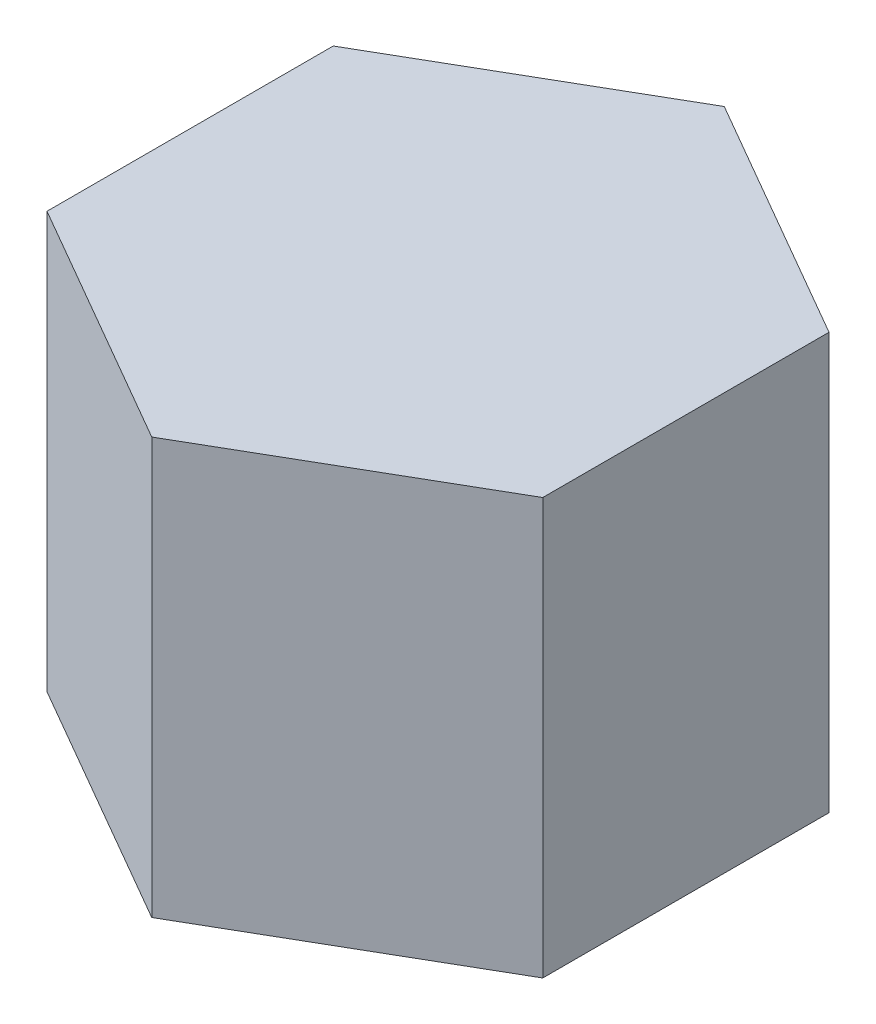
ISO-10303-21;
HEADER;
FILE_DESCRIPTION(('STEP AP214'),'2;1');
FILE_NAME('part.step','',(''),(''),'','','');
FILE_SCHEMA(('AUTOMOTIVE_DESIGN { 1 0 10303 214 1 1 1 1 }'));
ENDSEC;
DATA;
#1=APPLICATION_CONTEXT('core data for automotive mechanical design processes');
#2=APPLICATION_PROTOCOL_DEFINITION('international standard','automotive_design',2000,#1);
#3=PRODUCT_CONTEXT('',#1,'mechanical');
#4=PRODUCT('Part','Part','',(#3));
#5=PRODUCT_RELATED_PRODUCT_CATEGORY('part','',(#4));
#6=PRODUCT_DEFINITION_FORMATION('','',#4);
#7=PRODUCT_DEFINITION_CONTEXT('part definition',#1,'design');
#8=PRODUCT_DEFINITION('design','',#6,#7);
#9=PRODUCT_DEFINITION_SHAPE('','',#8);
#10=(LENGTH_UNIT() NAMED_UNIT(*) SI_UNIT(.MILLI.,.METRE.));
#11=(NAMED_UNIT(*) PLANE_ANGLE_UNIT() SI_UNIT($,.RADIAN.));
#12=(NAMED_UNIT(*) SI_UNIT($,.STERADIAN.) SOLID_ANGLE_UNIT());
#13=UNCERTAINTY_MEASURE_WITH_UNIT(LENGTH_MEASURE(1.E-05),#10,'distance_accuracy_value','');
#14=(GEOMETRIC_REPRESENTATION_CONTEXT(3) GLOBAL_UNCERTAINTY_ASSIGNED_CONTEXT((#13)) GLOBAL_UNIT_ASSIGNED_CONTEXT((#10,
#11,#12)) REPRESENTATION_CONTEXT('',''));
#15=CARTESIAN_POINT('',(0.,0.,0.));
#16=DIRECTION('',(0.,0.,1.));
#17=DIRECTION('',(1.,0.,0.));
#18=AXIS2_PLACEMENT_3D('',#15,#16,#17);
#19=CARTESIAN_POINT('',(207.839551417382,-147.556598747966,292.547996624279));
#20=DIRECTION('',(-0.500000000000028,0.,-0.866025403784422));
#21=DIRECTION('',(-0.866025403784423,0.,0.500000000000028));
#22=AXIS2_PLACEMENT_3D('',#19,#20,#21);
#23=PLANE('',#22);
#24=CARTESIAN_POINT('',(208.142660308706,-147.047793579175,292.372996624279));
#25=DIRECTION('',(-0.866025403784422,0.,0.500000000000028));
#26=VECTOR('',#25,1.);
#27=LINE('',#24,#26);
#28=CARTESIAN_POINT('',(208.142660308706,-147.047793579175,292.372996624279));
#29=VERTEX_POINT('',#28);
#30=CARTESIAN_POINT('',(207.839551417382,-147.047793579175,292.547996624279));
#31=VERTEX_POINT('',#30);
#32=EDGE_CURVE('E170',#29,#31,#27,.T.);
#33=ORIENTED_EDGE('',*,*,#32,.T.);
#34=CARTESIAN_POINT('',(207.839551417382,-147.556598747966,292.547996624279));
#35=DIRECTION('',(0.,1.,0.));
#36=VECTOR('',#35,1.);
#37=LINE('',#34,#36);
#38=CARTESIAN_POINT('',(207.839551417382,-147.556598747966,292.547996624279));
#39=VERTEX_POINT('',#38);
#40=EDGE_CURVE('E35',#39,#31,#37,.T.);
#41=ORIENTED_EDGE('',*,*,#40,.F.);
#42=CARTESIAN_POINT('',(208.142660308706,-147.556598747966,292.372996624279));
#43=DIRECTION('',(-0.866025403784422,0.,0.500000000000028));
#44=VECTOR('',#43,1.);
#45=LINE('',#42,#44);
#46=CARTESIAN_POINT('',(208.142660308706,-147.556598747966,292.372996624279));
#47=VERTEX_POINT('',#46);
#48=EDGE_CURVE('E159',#47,#39,#45,.T.);
#49=ORIENTED_EDGE('',*,*,#48,.F.);
#50=CARTESIAN_POINT('',(208.142660308706,-147.556598747966,292.372996624279));
#51=DIRECTION('',(0.,1.,0.));
#52=VECTOR('',#51,1.);
#53=LINE('',#50,#52);
#54=EDGE_CURVE('E10',#47,#29,#53,.T.);
#55=ORIENTED_EDGE('',*,*,#54,.T.);
#56=EDGE_LOOP('',(#33,#41,#49,#55));
#57=FACE_BOUND('',#56,.T.);
#58=ADVANCED_FACE('F16',(#57),#23,.F.);
#59=CARTESIAN_POINT('',(208.142660308706,-147.556598747966,291.594471220494));
#60=DIRECTION('',(-1.,0.,0.));
#61=DIRECTION('',(0.,-1.,0.));
#62=AXIS2_PLACEMENT_3D('',#59,#60,#61);
#63=PLANE('',#62);
#64=CARTESIAN_POINT('',(208.142660308706,-147.047793579175,292.022996624279));
#65=DIRECTION('',(0.,0.,1.));
#66=VECTOR('',#65,1.);
#67=LINE('',#64,#66);
#68=CARTESIAN_POINT('',(208.142660308706,-147.047793579175,292.022996624279));
#69=VERTEX_POINT('',#68);
#70=EDGE_CURVE('E167',#69,#29,#67,.T.);
#71=ORIENTED_EDGE('',*,*,#70,.T.);
#72=ORIENTED_EDGE('',*,*,#54,.F.);
#73=CARTESIAN_POINT('',(208.142660308706,-147.556598747966,292.022996624279));
#74=DIRECTION('',(0.,0.,1.));
#75=VECTOR('',#74,1.);
#76=LINE('',#73,#75);
#77=CARTESIAN_POINT('',(208.142660308706,-147.556598747966,292.022996624279));
#78=VERTEX_POINT('',#77);
#79=EDGE_CURVE('E156',#78,#47,#76,.T.);
#80=ORIENTED_EDGE('',*,*,#79,.F.);
#81=CARTESIAN_POINT('',(208.142660308706,-147.556598747966,292.022996624279));
#82=DIRECTION('',(0.,1.,0.));
#83=VECTOR('',#82,1.);
#84=LINE('',#81,#83);
#85=EDGE_CURVE('E27',#78,#69,#84,.T.);
#86=ORIENTED_EDGE('',*,*,#85,.T.);
#87=EDGE_LOOP('',(#71,#72,#80,#86));
#88=FACE_BOUND('',#87,.T.);
#89=ADVANCED_FACE('F189',(#88),#63,.F.);
#90=CARTESIAN_POINT('',(208.142660308706,-147.556598747966,292.022996624279));
#91=DIRECTION('',(-0.500000000000028,0.,0.866025403784422));
#92=DIRECTION('',(0.866025403784423,0.,0.500000000000028));
#93=AXIS2_PLACEMENT_3D('',#90,#91,#92);
#94=PLANE('',#93);
#95=CARTESIAN_POINT('',(207.839551417381,-147.047793579175,291.847996624279));
#96=DIRECTION('',(0.866025403784422,0.,0.500000000000028));
#97=VECTOR('',#96,1.);
#98=LINE('',#95,#97);
#99=CARTESIAN_POINT('',(207.839551417382,-147.047793579175,291.847996624279));
#100=VERTEX_POINT('',#99);
#101=EDGE_CURVE('E163',#100,#69,#98,.T.);
#102=ORIENTED_EDGE('',*,*,#101,.T.);
#103=ORIENTED_EDGE('',*,*,#85,.F.);
#104=CARTESIAN_POINT('',(207.839551417381,-147.556598747966,291.847996624279));
#105=DIRECTION('',(0.866025403784422,0.,0.500000000000028));
#106=VECTOR('',#105,1.);
#107=LINE('',#104,#106);
#108=CARTESIAN_POINT('',(207.839551417382,-147.556598747966,291.847996624279));
#109=VERTEX_POINT('',#108);
#110=EDGE_CURVE('E106',#109,#78,#107,.T.);
#111=ORIENTED_EDGE('',*,*,#110,.F.);
#112=CARTESIAN_POINT('',(207.839551417382,-147.556598747966,291.847996624279));
#113=DIRECTION('',(0.,1.,0.));
#114=VECTOR('',#113,1.);
#115=LINE('',#112,#114);
#116=EDGE_CURVE('E94',#109,#100,#115,.T.);
#117=ORIENTED_EDGE('',*,*,#116,.T.);
#118=EDGE_LOOP('',(#102,#103,#111,#117));
#119=FACE_BOUND('',#118,.T.);
#120=ADVANCED_FACE('F198',(#119),#94,.F.);
#121=CARTESIAN_POINT('',(207.839551417382,-147.556598747966,291.847996624279));
#122=DIRECTION('',(0.499999999999943,0.,0.866025403784471));
#123=DIRECTION('',(0.866025403784471,0.,-0.499999999999943));
#124=AXIS2_PLACEMENT_3D('',#121,#122,#123);
#125=PLANE('',#124);
#126=CARTESIAN_POINT('',(207.536442526057,-147.047793579175,292.022996624279));
#127=DIRECTION('',(0.866025403784471,0.,-0.499999999999943));
#128=VECTOR('',#127,1.);
#129=LINE('',#126,#128);
#130=CARTESIAN_POINT('',(207.536442526057,-147.047793579175,292.022996624279));
#131=VERTEX_POINT('',#130);
#132=EDGE_CURVE('E162',#131,#100,#129,.T.);
#133=ORIENTED_EDGE('',*,*,#132,.T.);
#134=ORIENTED_EDGE('',*,*,#116,.F.);
#135=CARTESIAN_POINT('',(207.536442526057,-147.556598747966,292.022996624279));
#136=DIRECTION('',(0.866025403784471,0.,-0.499999999999943));
#137=VECTOR('',#136,1.);
#138=LINE('',#135,#137);
#139=CARTESIAN_POINT('',(207.536442526057,-147.556598747966,292.022996624279));
#140=VERTEX_POINT('',#139);
#141=EDGE_CURVE('E98',#140,#109,#138,.T.);
#142=ORIENTED_EDGE('',*,*,#141,.F.);
#143=CARTESIAN_POINT('',(207.536442526057,-147.556598747966,292.022996624279));
#144=DIRECTION('',(0.,1.,0.));
#145=VECTOR('',#144,1.);
#146=LINE('',#143,#145);
#147=EDGE_CURVE('E79',#140,#131,#146,.T.);
#148=ORIENTED_EDGE('',*,*,#147,.T.);
#149=EDGE_LOOP('',(#133,#134,#142,#148));
#150=FACE_BOUND('',#149,.T.);
#151=ADVANCED_FACE('F100',(#150),#125,.F.);
#152=CARTESIAN_POINT('',(207.536442526057,-147.556598747966,291.594471220494));
#153=DIRECTION('',(1.,0.,0.));
#154=DIRECTION('',(0.,1.,0.));
#155=AXIS2_PLACEMENT_3D('',#152,#153,#154);
#156=PLANE('',#155);
#157=CARTESIAN_POINT('',(207.536442526057,-147.047793579175,292.372996624279));
#158=DIRECTION('',(0.,0.,-1.));
#159=VECTOR('',#158,1.);
#160=LINE('',#157,#159);
#161=CARTESIAN_POINT('',(207.536442526057,-147.047793579175,292.372996624279));
#162=VERTEX_POINT('',#161);
#163=EDGE_CURVE('E88',#162,#131,#160,.T.);
#164=ORIENTED_EDGE('',*,*,#163,.T.);
#165=ORIENTED_EDGE('',*,*,#147,.F.);
#166=CARTESIAN_POINT('',(207.536442526057,-147.556598747966,292.372996624279));
#167=DIRECTION('',(0.,0.,-1.));
#168=VECTOR('',#167,1.);
#169=LINE('',#166,#168);
#170=CARTESIAN_POINT('',(207.536442526057,-147.556598747966,292.372996624279));
#171=VERTEX_POINT('',#170);
#172=EDGE_CURVE('E84',#171,#140,#169,.T.);
#173=ORIENTED_EDGE('',*,*,#172,.F.);
#174=CARTESIAN_POINT('',(207.536442526057,-147.556598747966,292.372996624279));
#175=DIRECTION('',(0.,1.,0.));
#176=VECTOR('',#175,1.);
#177=LINE('',#174,#176);
#178=EDGE_CURVE('E58',#171,#162,#177,.T.);
#179=ORIENTED_EDGE('',*,*,#178,.T.);
#180=EDGE_LOOP('',(#164,#165,#173,#179));
#181=FACE_BOUND('',#180,.T.);
#182=ADVANCED_FACE('F82',(#181),#156,.F.);
#183=CARTESIAN_POINT('',(207.536442526057,-147.556598747966,292.372996624279));
#184=DIRECTION('',(0.500000000000062,0.,-0.866025403784403));
#185=DIRECTION('',(-0.866025403784403,0.,-0.500000000000062));
#186=AXIS2_PLACEMENT_3D('',#183,#184,#185);
#187=PLANE('',#186);
#188=CARTESIAN_POINT('',(207.839551417382,-147.047793579175,292.547996624279));
#189=DIRECTION('',(-0.866025403784403,0.,-0.500000000000062));
#190=VECTOR('',#189,1.);
#191=LINE('',#188,#190);
#192=EDGE_CURVE('E160',#31,#162,#191,.T.);
#193=ORIENTED_EDGE('',*,*,#192,.T.);
#194=ORIENTED_EDGE('',*,*,#178,.F.);
#195=CARTESIAN_POINT('',(207.839551417382,-147.556598747966,292.547996624279));
#196=DIRECTION('',(-0.866025403784403,0.,-0.500000000000062));
#197=VECTOR('',#196,1.);
#198=LINE('',#195,#197);
#199=EDGE_CURVE('E112',#39,#171,#198,.T.);
#200=ORIENTED_EDGE('',*,*,#199,.F.);
#201=ORIENTED_EDGE('',*,*,#40,.T.);
#202=EDGE_LOOP('',(#193,#194,#200,#201));
#203=FACE_BOUND('',#202,.T.);
#204=ADVANCED_FACE('F131',(#203),#187,.F.);
#205=CARTESIAN_POINT('',(206.491105863044,-147.556598747966,291.594471220494));
#206=DIRECTION('',(0.,1.,0.));
#207=DIRECTION('',(-1.,0.,0.));
#208=AXIS2_PLACEMENT_3D('',#205,#206,#207);
#209=PLANE('',#208);
#210=ORIENTED_EDGE('',*,*,#48,.T.);
#211=ORIENTED_EDGE('',*,*,#199,.T.);
#212=ORIENTED_EDGE('',*,*,#172,.T.);
#213=ORIENTED_EDGE('',*,*,#141,.T.);
#214=ORIENTED_EDGE('',*,*,#110,.T.);
#215=ORIENTED_EDGE('',*,*,#79,.T.);
#216=EDGE_LOOP('',(#210,#211,#212,#213,#214,#215));
#217=FACE_BOUND('',#216,.T.);
#218=ADVANCED_FACE('F111',(#217),#209,.F.);
#219=CARTESIAN_POINT('',(206.491105863044,-147.047793579175,291.594471220494));
#220=DIRECTION('',(0.,1.,0.));
#221=DIRECTION('',(-1.,0.,0.));
#222=AXIS2_PLACEMENT_3D('',#219,#220,#221);
#223=PLANE('',#222);
#224=ORIENTED_EDGE('',*,*,#32,.F.);
#225=ORIENTED_EDGE('',*,*,#70,.F.);
#226=ORIENTED_EDGE('',*,*,#101,.F.);
#227=ORIENTED_EDGE('',*,*,#132,.F.);
#228=ORIENTED_EDGE('',*,*,#163,.F.);
#229=ORIENTED_EDGE('',*,*,#192,.F.);
#230=EDGE_LOOP('',(#224,#225,#226,#227,#228,#229));
#231=FACE_BOUND('',#230,.T.);
#232=ADVANCED_FACE('F130',(#231),#223,.T.);
#233=CLOSED_SHELL('',(#58,#89,#120,#151,#182,#204,#218,#232));
#234=MANIFOLD_SOLID_BREP('B1',#233);
#235=ADVANCED_BREP_SHAPE_REPRESENTATION('',(#18,#234),#14);
#236=SHAPE_DEFINITION_REPRESENTATION(#9,#235);
ENDSEC;
END-ISO-10303-21;
